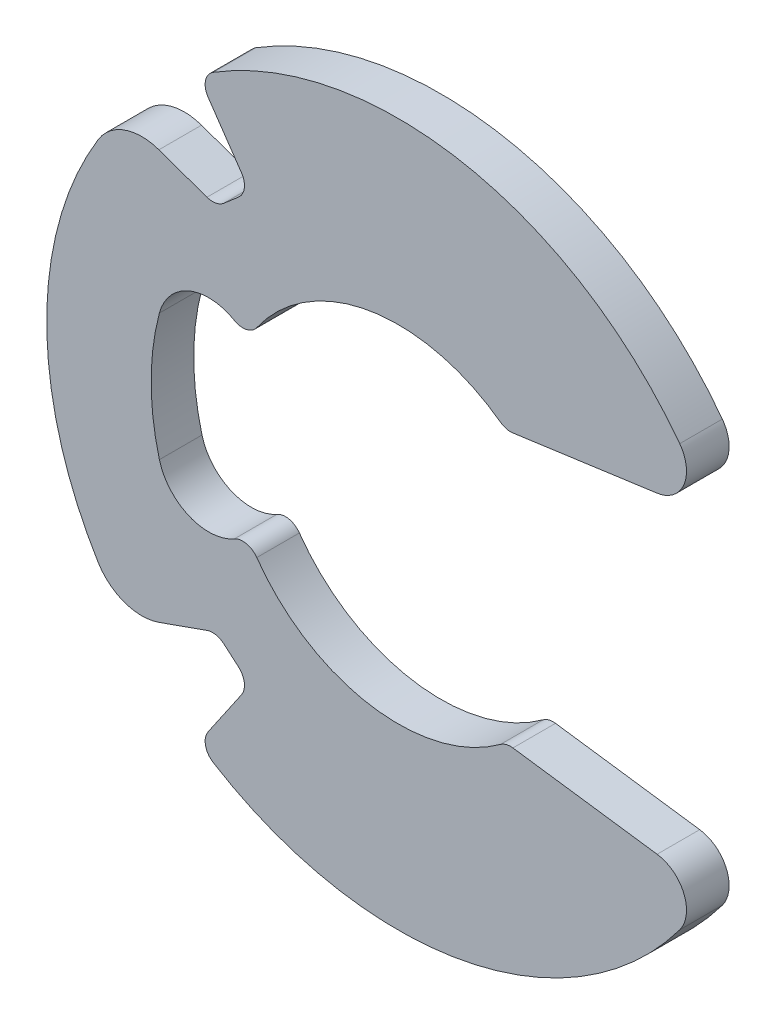
ISO-10303-21;
HEADER;
FILE_DESCRIPTION(('STEP AP214'),'2;1');
FILE_NAME('part.step','',(''),(''),'','','');
FILE_SCHEMA(('AUTOMOTIVE_DESIGN { 1 0 10303 214 1 1 1 1 }'));
ENDSEC;
DATA;
#1=APPLICATION_CONTEXT('core data for automotive mechanical design processes');
#2=APPLICATION_PROTOCOL_DEFINITION('international standard','automotive_design',2000,#1);
#3=PRODUCT_CONTEXT('',#1,'mechanical');
#4=PRODUCT('Part','Part','',(#3));
#5=PRODUCT_RELATED_PRODUCT_CATEGORY('part','',(#4));
#6=PRODUCT_DEFINITION_FORMATION('','',#4);
#7=PRODUCT_DEFINITION_CONTEXT('part definition',#1,'design');
#8=PRODUCT_DEFINITION('design','',#6,#7);
#9=PRODUCT_DEFINITION_SHAPE('','',#8);
#10=(LENGTH_UNIT() NAMED_UNIT(*) SI_UNIT(.MILLI.,.METRE.));
#11=(NAMED_UNIT(*) PLANE_ANGLE_UNIT() SI_UNIT($,.RADIAN.));
#12=(NAMED_UNIT(*) SI_UNIT($,.STERADIAN.) SOLID_ANGLE_UNIT());
#13=UNCERTAINTY_MEASURE_WITH_UNIT(LENGTH_MEASURE(1.E-05),#10,'distance_accuracy_value','');
#14=(GEOMETRIC_REPRESENTATION_CONTEXT(3) GLOBAL_UNCERTAINTY_ASSIGNED_CONTEXT((#13)) GLOBAL_UNIT_ASSIGNED_CONTEXT((#10,
#11,#12)) REPRESENTATION_CONTEXT('',''));
#15=CARTESIAN_POINT('',(0.,0.,0.));
#16=DIRECTION('',(0.,0.,1.));
#17=DIRECTION('',(1.,0.,0.));
#18=AXIS2_PLACEMENT_3D('',#15,#16,#17);
#19=CARTESIAN_POINT('',(0.,0.,1.27));
#20=DIRECTION('',(0.,0.,-1.));
#21=DIRECTION('',(-1.,0.,0.));
#22=AXIS2_PLACEMENT_3D('',#19,#20,#21);
#23=PLANE('',#22);
#24=CARTESIAN_POINT('',(0.,0.,1.27));
#25=DIRECTION('',(0.,0.,-1.));
#26=DIRECTION('',(1.,0.,0.));
#27=AXIS2_PLACEMENT_3D('',#24,#25,#26);
#28=CIRCLE('',#27,10.4775);
#29=CARTESIAN_POINT('',(8.39050144990017,-6.27514873682076,1.27));
#30=VERTEX_POINT('',#29);
#31=CARTESIAN_POINT('',(-5.51465485817055,-8.90879273780998,1.27));
#32=VERTEX_POINT('',#31);
#33=EDGE_CURVE('E433',#30,#32,#28,.T.);
#34=ORIENTED_EDGE('',*,*,#33,.F.);
#35=CARTESIAN_POINT('',(7.57687706687955,-5.66664946537147,1.27));
#36=DIRECTION('',(0.,0.,-1.));
#37=DIRECTION('',(-1.,0.,0.));
#38=AXIS2_PLACEMENT_3D('',#35,#36,#37);
#39=CIRCLE('',#38,1.016);
#40=CARTESIAN_POINT('',(7.71621548730132,-4.66024954258016,1.27));
#41=VERTEX_POINT('',#40);
#42=EDGE_CURVE('E11',#30,#41,#39,.F.);
#43=ORIENTED_EDGE('',*,*,#42,.T.);
#44=DIRECTION('',(0.990551105109562,-0.137144114588364,0.));
#45=VECTOR('',#44,1.);
#46=CARTESIAN_POINT('',(0.,-3.59192148204873,1.27));
#47=LINE('',#46,#45);
#48=CARTESIAN_POINT('',(3.41825205926127,-4.06518646523744,1.27));
#49=VERTEX_POINT('',#48);
#50=EDGE_CURVE('E397',#49,#41,#47,.T.);
#51=ORIENTED_EDGE('',*,*,#50,.F.);
#52=CARTESIAN_POINT('',(3.34858284905039,-4.5683864266331,1.27));
#53=DIRECTION('',(0.,0.,-1.));
#54=DIRECTION('',(-1.,0.,0.));
#55=AXIS2_PLACEMENT_3D('',#52,#53,#54);
#56=CIRCLE('',#55,0.508);
#57=CARTESIAN_POINT('',(3.04826151729699,-4.15866567088125,1.27));
#58=VERTEX_POINT('',#57);
#59=EDGE_CURVE('E360',#49,#58,#56,.F.);
#60=ORIENTED_EDGE('',*,*,#59,.T.);
#61=CARTESIAN_POINT('',(0.,0.,1.27));
#62=DIRECTION('',(0.,0.,-1.));
#63=DIRECTION('',(1.,0.,0.));
#64=AXIS2_PLACEMENT_3D('',#61,#62,#63);
#65=CIRCLE('',#64,5.1562);
#66=CARTESIAN_POINT('',(-4.21618561440545,-2.96819428354689,1.27));
#67=VERTEX_POINT('',#66);
#68=EDGE_CURVE('E437',#58,#67,#65,.T.);
#69=ORIENTED_EDGE('',*,*,#68,.T.);
#70=CARTESIAN_POINT('',(-4.63157335966707,-3.26062721788649,1.27));
#71=DIRECTION('',(0.,0.,-1.));
#72=DIRECTION('',(-1.,0.,0.));
#73=AXIS2_PLACEMENT_3D('',#70,#71,#72);
#74=CIRCLE('',#73,0.508);
#75=CARTESIAN_POINT('',(-4.88521418696267,-2.82047913970278,1.27));
#76=VERTEX_POINT('',#75);
#77=EDGE_CURVE('E369',#67,#76,#74,.F.);
#78=ORIENTED_EDGE('',*,*,#77,.T.);
#79=CARTESIAN_POINT('',(-5.64613666884946,-1.50003490515168,1.27));
#80=DIRECTION('',(0.,0.,-1.));
#81=DIRECTION('',(-1.,0.,0.));
#82=AXIS2_PLACEMENT_3D('',#79,#80,#81);
#83=CIRCLE('',#82,1.524);
#84=CARTESIAN_POINT('',(-7.11904188681019,-1.89134835866951,1.27));
#85=VERTEX_POINT('',#84);
#86=EDGE_CURVE('E262',#76,#85,#83,.T.);
#87=ORIENTED_EDGE('',*,*,#86,.T.);
#88=CARTESIAN_POINT('',(0.,0.,1.27));
#89=DIRECTION('',(0.,0.,-1.));
#90=DIRECTION('',(0.,1.,0.));
#91=AXIS2_PLACEMENT_3D('',#88,#89,#90);
#92=CIRCLE('',#91,7.366);
#93=CARTESIAN_POINT('',(-7.1190418868102,1.89134835866951,1.27));
#94=VERTEX_POINT('',#93);
#95=EDGE_CURVE('E469',#85,#94,#92,.T.);
#96=ORIENTED_EDGE('',*,*,#95,.T.);
#97=CARTESIAN_POINT('',(-5.64613666884946,1.50003490515168,1.27));
#98=DIRECTION('',(0.,0.,-1.));
#99=DIRECTION('',(-1.,0.,0.));
#100=AXIS2_PLACEMENT_3D('',#97,#98,#99);
#101=CIRCLE('',#100,1.524);
#102=CARTESIAN_POINT('',(-4.88521418696268,2.82047913970278,1.27));
#103=VERTEX_POINT('',#102);
#104=EDGE_CURVE('E270',#94,#103,#101,.T.);
#105=ORIENTED_EDGE('',*,*,#104,.T.);
#106=CARTESIAN_POINT('',(-4.63157335966708,3.26062721788649,1.27));
#107=DIRECTION('',(0.,0.,-1.));
#108=DIRECTION('',(-1.,0.,0.));
#109=AXIS2_PLACEMENT_3D('',#106,#107,#108);
#110=CIRCLE('',#109,0.508);
#111=CARTESIAN_POINT('',(-4.21618561440546,2.96819428354689,1.27));
#112=VERTEX_POINT('',#111);
#113=EDGE_CURVE('E374',#103,#112,#110,.F.);
#114=ORIENTED_EDGE('',*,*,#113,.T.);
#115=CARTESIAN_POINT('',(3.048261517297,4.15866567088126,1.27));
#116=VERTEX_POINT('',#115);
#117=EDGE_CURVE('E435',#112,#116,#65,.T.);
#118=ORIENTED_EDGE('',*,*,#117,.T.);
#119=CARTESIAN_POINT('',(3.3485828490504,4.5683864266331,1.27));
#120=DIRECTION('',(0.,0.,-1.));
#121=DIRECTION('',(-1.,0.,0.));
#122=AXIS2_PLACEMENT_3D('',#119,#120,#121);
#123=CIRCLE('',#122,0.508);
#124=CARTESIAN_POINT('',(3.41825205926129,4.06518646523744,1.27));
#125=VERTEX_POINT('',#124);
#126=EDGE_CURVE('E288',#116,#125,#123,.F.);
#127=ORIENTED_EDGE('',*,*,#126,.T.);
#128=DIRECTION('',(-0.990551105109562,-0.137144114588364,0.));
#129=VECTOR('',#128,1.);
#130=CARTESIAN_POINT('',(11.2983179723503,5.15619999999999,1.27));
#131=LINE('',#130,#129);
#132=CARTESIAN_POINT('',(7.71621548730134,4.66024954258016,1.27));
#133=VERTEX_POINT('',#132);
#134=EDGE_CURVE('E412',#133,#125,#131,.T.);
#135=ORIENTED_EDGE('',*,*,#134,.F.);
#136=CARTESIAN_POINT('',(7.57687706687956,5.66664946537147,1.27));
#137=DIRECTION('',(0.,0.,-1.));
#138=DIRECTION('',(-1.,0.,0.));
#139=AXIS2_PLACEMENT_3D('',#136,#137,#138);
#140=CIRCLE('',#139,1.016);
#141=CARTESIAN_POINT('',(8.39050144990018,6.27514873682076,1.27));
#142=VERTEX_POINT('',#141);
#143=EDGE_CURVE('E383',#133,#142,#140,.F.);
#144=ORIENTED_EDGE('',*,*,#143,.T.);
#145=CARTESIAN_POINT('',(-5.51465485817056,8.90879273780999,1.27));
#146=VERTEX_POINT('',#145);
#147=EDGE_CURVE('E432',#146,#142,#28,.T.);
#148=ORIENTED_EDGE('',*,*,#147,.F.);
#149=CARTESIAN_POINT('',(-5.24727765292592,8.47685127173435,1.27));
#150=DIRECTION('',(0.,0.,-1.));
#151=DIRECTION('',(-1.,0.,0.));
#152=AXIS2_PLACEMENT_3D('',#149,#150,#151);
#153=CIRCLE('',#152,0.508);
#154=CARTESIAN_POINT('',(-5.6664647231543,8.18989099547063,1.27));
#155=VERTEX_POINT('',#154);
#156=EDGE_CURVE('E346',#146,#155,#153,.F.);
#157=ORIENTED_EDGE('',*,*,#156,.T.);
#158=DIRECTION('',(0.564882433590001,-0.825171398087354,0.));
#159=VECTOR('',#158,1.);
#160=CARTESIAN_POINT('',(-7.96096866359448,11.541666359447,1.27));
#161=LINE('',#160,#159);
#162=CARTESIAN_POINT('',(-4.67174469224146,6.73681957776462,1.27));
#163=VERTEX_POINT('',#162);
#164=EDGE_CURVE('E466',#155,#163,#161,.T.);
#165=ORIENTED_EDGE('',*,*,#164,.T.);
#166=CARTESIAN_POINT('',(-5.09093176246983,6.4498593015009,1.27));
#167=DIRECTION('',(0.,0.,-1.));
#168=DIRECTION('',(-1.,0.,0.));
#169=AXIS2_PLACEMENT_3D('',#166,#167,#168);
#170=CIRCLE('',#169,0.508);
#171=CARTESIAN_POINT('',(-4.75923843445855,6.0650950410078,1.27));
#172=VERTEX_POINT('',#171);
#173=EDGE_CURVE('E318',#163,#172,#170,.T.);
#174=ORIENTED_EDGE('',*,*,#173,.T.);
#175=DIRECTION('',(-0.757409961600578,-0.652939622069462,0.));
#176=VECTOR('',#175,1.);
#177=CARTESIAN_POINT('',(-4.41503502304148,6.36182211981562,1.27));
#178=LINE('',#177,#176);
#179=CARTESIAN_POINT('',(-5.19974545035898,5.68534761350743,1.27));
#180=VERTEX_POINT('',#179);
#181=EDGE_CURVE('E461',#172,#180,#178,.T.);
#182=ORIENTED_EDGE('',*,*,#181,.T.);
#183=CARTESIAN_POINT('',(-5.53143877837027,6.07011187400052,1.27));
#184=DIRECTION('',(0.,0.,-1.));
#185=DIRECTION('',(-1.,0.,0.));
#186=AXIS2_PLACEMENT_3D('',#183,#184,#185);
#187=CIRCLE('',#186,0.508);
#188=CARTESIAN_POINT('',(-5.70123922502142,5.59133028672186,1.27));
#189=VERTEX_POINT('',#188);
#190=EDGE_CURVE('E309',#180,#189,#187,.T.);
#191=ORIENTED_EDGE('',*,*,#190,.T.);
#192=DIRECTION('',(-0.942483439524914,0.334252847738487,0.));
#193=VECTOR('',#192,1.);
#194=CARTESIAN_POINT('',(-5.42319262672811,5.49272073732714,1.27));
#195=LINE('',#194,#193);
#196=CARTESIAN_POINT('',(-7.13394241485243,6.09944013892937,1.27));
#197=VERTEX_POINT('',#196);
#198=EDGE_CURVE('E455',#189,#197,#195,.T.);
#199=ORIENTED_EDGE('',*,*,#198,.T.);
#200=CARTESIAN_POINT('',(-7.64334375480589,4.6630953770934,1.27));
#201=DIRECTION('',(0.,0.,-1.));
#202=DIRECTION('',(-1.,0.,0.));
#203=AXIS2_PLACEMENT_3D('',#200,#201,#202);
#204=CIRCLE('',#203,1.524);
#205=CARTESIAN_POINT('',(-8.94433843647498,5.45681373915185,1.27));
#206=VERTEX_POINT('',#205);
#207=EDGE_CURVE('E283',#197,#206,#204,.F.);
#208=ORIENTED_EDGE('',*,*,#207,.T.);
#209=CARTESIAN_POINT('',(-8.94433843647497,-5.45681373915185,1.27));
#210=VERTEX_POINT('',#209);
#211=EDGE_CURVE('E436',#210,#206,#28,.T.);
#212=ORIENTED_EDGE('',*,*,#211,.F.);
#213=CARTESIAN_POINT('',(-7.64334375480588,-4.6630953770934,1.27));
#214=DIRECTION('',(0.,0.,-1.));
#215=DIRECTION('',(-1.,0.,0.));
#216=AXIS2_PLACEMENT_3D('',#213,#214,#215);
#217=CIRCLE('',#216,1.524);
#218=CARTESIAN_POINT('',(-7.13394241485243,-6.09944013892937,1.27));
#219=VERTEX_POINT('',#218);
#220=EDGE_CURVE('E257',#210,#219,#217,.F.);
#221=ORIENTED_EDGE('',*,*,#220,.T.);
#222=DIRECTION('',(-0.942483439524914,-0.334252847738487,0.));
#223=VECTOR('',#222,1.);
#224=CARTESIAN_POINT('',(-5.42319262672811,-5.49272073732714,1.27));
#225=LINE('',#224,#223);
#226=CARTESIAN_POINT('',(-5.70123922502142,-5.59133028672186,1.27));
#227=VERTEX_POINT('',#226);
#228=EDGE_CURVE('E228',#227,#219,#225,.T.);
#229=ORIENTED_EDGE('',*,*,#228,.F.);
#230=CARTESIAN_POINT('',(-5.53143877837027,-6.07011187400052,1.27));
#231=DIRECTION('',(0.,0.,-1.));
#232=DIRECTION('',(-1.,0.,0.));
#233=AXIS2_PLACEMENT_3D('',#230,#231,#232);
#234=CIRCLE('',#233,0.508);
#235=CARTESIAN_POINT('',(-5.19974545035898,-5.68534761350743,1.27));
#236=VERTEX_POINT('',#235);
#237=EDGE_CURVE('E300',#227,#236,#234,.T.);
#238=ORIENTED_EDGE('',*,*,#237,.T.);
#239=DIRECTION('',(-0.757409961600578,0.652939622069462,0.));
#240=VECTOR('',#239,1.);
#241=CARTESIAN_POINT('',(-4.41503502304148,-6.36182211981562,1.27));
#242=LINE('',#241,#240);
#243=CARTESIAN_POINT('',(-4.75923843445855,-6.0650950410078,1.27));
#244=VERTEX_POINT('',#243);
#245=EDGE_CURVE('E422',#244,#236,#242,.T.);
#246=ORIENTED_EDGE('',*,*,#245,.F.);
#247=CARTESIAN_POINT('',(-5.09093176246983,-6.4498593015009,1.27));
#248=DIRECTION('',(0.,0.,-1.));
#249=DIRECTION('',(-1.,0.,0.));
#250=AXIS2_PLACEMENT_3D('',#247,#248,#249);
#251=CIRCLE('',#250,0.508);
#252=CARTESIAN_POINT('',(-4.67174469224146,-6.73681957776462,1.27));
#253=VERTEX_POINT('',#252);
#254=EDGE_CURVE('E327',#244,#253,#251,.T.);
#255=ORIENTED_EDGE('',*,*,#254,.T.);
#256=DIRECTION('',(0.564882433590001,0.825171398087354,0.));
#257=VECTOR('',#256,1.);
#258=CARTESIAN_POINT('',(-7.96096866359448,-11.541666359447,1.27));
#259=LINE('',#258,#257);
#260=CARTESIAN_POINT('',(-5.66646472315429,-8.18989099547062,1.27));
#261=VERTEX_POINT('',#260);
#262=EDGE_CURVE('E452',#261,#253,#259,.T.);
#263=ORIENTED_EDGE('',*,*,#262,.F.);
#264=CARTESIAN_POINT('',(-5.24727765292592,-8.47685127173434,1.27));
#265=DIRECTION('',(0.,0.,-1.));
#266=DIRECTION('',(-1.,0.,0.));
#267=AXIS2_PLACEMENT_3D('',#264,#265,#266);
#268=CIRCLE('',#267,0.508);
#269=EDGE_CURVE('E335',#261,#32,#268,.F.);
#270=ORIENTED_EDGE('',*,*,#269,.T.);
#271=EDGE_LOOP('',(#34,#43,#51,#60,#69,#78,#87,#96,#105,#114,#118,#127,#135,#144,#148,#157,#165,
#174,#182,#191,#199,#208,#212,#221,#229,#238,#246,#255,#263,#270));
#272=FACE_BOUND('',#271,.T.);
#273=ADVANCED_FACE('F16',(#272),#23,.F.);
#274=CARTESIAN_POINT('',(0.,0.,0.));
#275=DIRECTION('',(0.,0.,-1.));
#276=DIRECTION('',(-1.,0.,0.));
#277=AXIS2_PLACEMENT_3D('',#274,#275,#276);
#278=PLANE('',#277);
#279=DIRECTION('',(-0.990551105109562,0.137144114588364,0.));
#280=VECTOR('',#279,1.);
#281=CARTESIAN_POINT('',(-0.487956262792466,-3.52436279752117,0.));
#282=LINE('',#281,#280);
#283=CARTESIAN_POINT('',(7.71621548730133,-4.66024954258016,0.));
#284=VERTEX_POINT('',#283);
#285=CARTESIAN_POINT('',(3.41825205926127,-4.06518646523744,0.));
#286=VERTEX_POINT('',#285);
#287=EDGE_CURVE('E237',#284,#286,#282,.T.);
#288=ORIENTED_EDGE('',*,*,#287,.F.);
#289=CARTESIAN_POINT('',(7.57687706687955,-5.66664946537147,0.));
#290=DIRECTION('',(0.,0.,-1.));
#291=DIRECTION('',(-1.,0.,0.));
#292=AXIS2_PLACEMENT_3D('',#289,#290,#291);
#293=CIRCLE('',#292,1.016);
#294=CARTESIAN_POINT('',(8.39050144990017,-6.27514873682076,0.));
#295=VERTEX_POINT('',#294);
#296=EDGE_CURVE('E38',#284,#295,#293,.T.);
#297=ORIENTED_EDGE('',*,*,#296,.T.);
#298=CARTESIAN_POINT('',(0.,0.,0.));
#299=DIRECTION('',(0.,0.,-1.));
#300=DIRECTION('',(1.,0.,0.));
#301=AXIS2_PLACEMENT_3D('',#298,#299,#300);
#302=CIRCLE('',#301,10.4775);
#303=CARTESIAN_POINT('',(-5.51465485817055,-8.90879273780998,0.));
#304=VERTEX_POINT('',#303);
#305=EDGE_CURVE('E426',#295,#304,#302,.T.);
#306=ORIENTED_EDGE('',*,*,#305,.T.);
#307=CARTESIAN_POINT('',(-5.24727765292592,-8.47685127173434,0.));
#308=DIRECTION('',(0.,0.,-1.));
#309=DIRECTION('',(-1.,0.,0.));
#310=AXIS2_PLACEMENT_3D('',#307,#308,#309);
#311=CIRCLE('',#310,0.508);
#312=CARTESIAN_POINT('',(-5.6664647231543,-8.18989099547062,0.));
#313=VERTEX_POINT('',#312);
#314=EDGE_CURVE('E341',#304,#313,#311,.T.);
#315=ORIENTED_EDGE('',*,*,#314,.T.);
#316=DIRECTION('',(-0.56488243359,-0.825171398087354,0.));
#317=VECTOR('',#316,1.);
#318=CARTESIAN_POINT('',(-0.0408287063206822,0.0279498526490687,0.));
#319=LINE('',#318,#317);
#320=CARTESIAN_POINT('',(-4.67174469224146,-6.73681957776462,0.));
#321=VERTEX_POINT('',#320);
#322=EDGE_CURVE('E240',#321,#313,#319,.T.);
#323=ORIENTED_EDGE('',*,*,#322,.F.);
#324=CARTESIAN_POINT('',(-5.09093176246983,-6.4498593015009,0.));
#325=DIRECTION('',(0.,0.,-1.));
#326=DIRECTION('',(-1.,0.,0.));
#327=AXIS2_PLACEMENT_3D('',#324,#325,#326);
#328=CIRCLE('',#327,0.508);
#329=CARTESIAN_POINT('',(-4.75923843445854,-6.0650950410078,0.));
#330=VERTEX_POINT('',#329);
#331=EDGE_CURVE('E330',#321,#330,#328,.F.);
#332=ORIENTED_EDGE('',*,*,#331,.T.);
#333=DIRECTION('',(0.757409961600578,-0.652939622069462,0.));
#334=VECTOR('',#333,1.);
#335=CARTESIAN_POINT('',(-5.02845697562567,-5.8330100917258,0.));
#336=LINE('',#335,#334);
#337=CARTESIAN_POINT('',(-5.19974545035898,-5.68534761350743,0.));
#338=VERTEX_POINT('',#337);
#339=EDGE_CURVE('E236',#338,#330,#336,.T.);
#340=ORIENTED_EDGE('',*,*,#339,.F.);
#341=CARTESIAN_POINT('',(-5.53143877837027,-6.07011187400052,0.));
#342=DIRECTION('',(0.,0.,-1.));
#343=DIRECTION('',(-1.,0.,0.));
#344=AXIS2_PLACEMENT_3D('',#341,#342,#343);
#345=CIRCLE('',#344,0.508);
#346=CARTESIAN_POINT('',(-5.70123922502142,-5.59133028672186,0.));
#347=VERTEX_POINT('',#346);
#348=EDGE_CURVE('E235',#338,#347,#345,.F.);
#349=ORIENTED_EDGE('',*,*,#348,.T.);
#350=DIRECTION('',(0.942483439524914,0.334252847738487,0.));
#351=VECTOR('',#350,1.);
#352=CARTESIAN_POINT('',(1.12445357189555,-3.17059039944317,0.));
#353=LINE('',#352,#351);
#354=CARTESIAN_POINT('',(-7.13394241485243,-6.09944013892937,0.));
#355=VERTEX_POINT('',#354);
#356=EDGE_CURVE('E225',#355,#347,#353,.T.);
#357=ORIENTED_EDGE('',*,*,#356,.F.);
#358=CARTESIAN_POINT('',(-7.64334375480588,-4.6630953770934,0.));
#359=DIRECTION('',(0.,0.,-1.));
#360=DIRECTION('',(-1.,0.,0.));
#361=AXIS2_PLACEMENT_3D('',#358,#359,#360);
#362=CIRCLE('',#361,1.524);
#363=CARTESIAN_POINT('',(-8.94433843647497,-5.45681373915185,0.));
#364=VERTEX_POINT('',#363);
#365=EDGE_CURVE('E211',#355,#364,#362,.T.);
#366=ORIENTED_EDGE('',*,*,#365,.T.);
#367=CARTESIAN_POINT('',(-8.94433843647498,5.45681373915185,0.));
#368=VERTEX_POINT('',#367);
#369=EDGE_CURVE('E430',#364,#368,#302,.T.);
#370=ORIENTED_EDGE('',*,*,#369,.T.);
#371=CARTESIAN_POINT('',(-7.64334375480589,4.6630953770934,0.));
#372=DIRECTION('',(0.,0.,-1.));
#373=DIRECTION('',(-1.,0.,0.));
#374=AXIS2_PLACEMENT_3D('',#371,#372,#373);
#375=CIRCLE('',#374,1.524);
#376=CARTESIAN_POINT('',(-7.13394241485243,6.09944013892937,0.));
#377=VERTEX_POINT('',#376);
#378=EDGE_CURVE('E278',#368,#377,#375,.T.);
#379=ORIENTED_EDGE('',*,*,#378,.T.);
#380=DIRECTION('',(0.942483439524914,-0.334252847738487,0.));
#381=VECTOR('',#380,1.);
#382=CARTESIAN_POINT('',(1.12445357189554,3.17059039944317,0.));
#383=LINE('',#382,#381);
#384=CARTESIAN_POINT('',(-5.70123922502143,5.59133028672186,0.));
#385=VERTEX_POINT('',#384);
#386=EDGE_CURVE('E252',#377,#385,#383,.T.);
#387=ORIENTED_EDGE('',*,*,#386,.T.);
#388=CARTESIAN_POINT('',(-5.53143877837027,6.07011187400052,0.));
#389=DIRECTION('',(0.,0.,-1.));
#390=DIRECTION('',(-1.,0.,0.));
#391=AXIS2_PLACEMENT_3D('',#388,#389,#390);
#392=CIRCLE('',#391,0.508);
#393=CARTESIAN_POINT('',(-5.19974545035898,5.68534761350743,0.));
#394=VERTEX_POINT('',#393);
#395=EDGE_CURVE('E311',#385,#394,#392,.F.);
#396=ORIENTED_EDGE('',*,*,#395,.T.);
#397=DIRECTION('',(0.757409961600578,0.652939622069462,0.));
#398=VECTOR('',#397,1.);
#399=CARTESIAN_POINT('',(-5.02845697562567,5.8330100917258,0.));
#400=LINE('',#399,#398);
#401=CARTESIAN_POINT('',(-4.75923843445855,6.0650950410078,0.));
#402=VERTEX_POINT('',#401);
#403=EDGE_CURVE('E249',#394,#402,#400,.T.);
#404=ORIENTED_EDGE('',*,*,#403,.T.);
#405=CARTESIAN_POINT('',(-5.09093176246983,6.4498593015009,0.));
#406=DIRECTION('',(0.,0.,-1.));
#407=DIRECTION('',(-1.,0.,0.));
#408=AXIS2_PLACEMENT_3D('',#405,#406,#407);
#409=CIRCLE('',#408,0.508);
#410=CARTESIAN_POINT('',(-4.67174469224146,6.73681957776462,0.));
#411=VERTEX_POINT('',#410);
#412=EDGE_CURVE('E320',#402,#411,#409,.F.);
#413=ORIENTED_EDGE('',*,*,#412,.T.);
#414=DIRECTION('',(-0.564882433590001,0.825171398087354,0.));
#415=VECTOR('',#414,1.);
#416=CARTESIAN_POINT('',(-0.0408287063206891,-0.0279498526490583,0.));
#417=LINE('',#416,#415);
#418=CARTESIAN_POINT('',(-5.6664647231543,8.18989099547063,0.));
#419=VERTEX_POINT('',#418);
#420=EDGE_CURVE('E246',#411,#419,#417,.T.);
#421=ORIENTED_EDGE('',*,*,#420,.T.);
#422=CARTESIAN_POINT('',(-5.24727765292592,8.47685127173435,0.));
#423=DIRECTION('',(0.,0.,-1.));
#424=DIRECTION('',(-1.,0.,0.));
#425=AXIS2_PLACEMENT_3D('',#422,#423,#424);
#426=CIRCLE('',#425,0.508);
#427=CARTESIAN_POINT('',(-5.51465485817056,8.90879273780999,0.));
#428=VERTEX_POINT('',#427);
#429=EDGE_CURVE('E350',#419,#428,#426,.T.);
#430=ORIENTED_EDGE('',*,*,#429,.T.);
#431=CARTESIAN_POINT('',(8.39050144990018,6.27514873682076,0.));
#432=VERTEX_POINT('',#431);
#433=EDGE_CURVE('E419',#428,#432,#302,.T.);
#434=ORIENTED_EDGE('',*,*,#433,.T.);
#435=CARTESIAN_POINT('',(7.57687706687956,5.66664946537147,0.));
#436=DIRECTION('',(0.,0.,-1.));
#437=DIRECTION('',(-1.,0.,0.));
#438=AXIS2_PLACEMENT_3D('',#435,#436,#437);
#439=CIRCLE('',#438,1.016);
#440=CARTESIAN_POINT('',(7.71621548730134,4.66024954258016,0.));
#441=VERTEX_POINT('',#440);
#442=EDGE_CURVE('E387',#432,#441,#439,.T.);
#443=ORIENTED_EDGE('',*,*,#442,.T.);
#444=DIRECTION('',(0.990551105109562,0.137144114588364,0.));
#445=VECTOR('',#444,1.);
#446=CARTESIAN_POINT('',(-0.487956262792459,3.52436279752117,0.));
#447=LINE('',#446,#445);
#448=CARTESIAN_POINT('',(3.41825205926129,4.06518646523744,0.));
#449=VERTEX_POINT('',#448);
#450=EDGE_CURVE('E242',#449,#441,#447,.T.);
#451=ORIENTED_EDGE('',*,*,#450,.F.);
#452=CARTESIAN_POINT('',(3.3485828490504,4.5683864266331,0.));
#453=DIRECTION('',(0.,0.,-1.));
#454=DIRECTION('',(-1.,0.,0.));
#455=AXIS2_PLACEMENT_3D('',#452,#453,#454);
#456=CIRCLE('',#455,0.508);
#457=CARTESIAN_POINT('',(3.048261517297,4.15866567088126,0.));
#458=VERTEX_POINT('',#457);
#459=EDGE_CURVE('E293',#449,#458,#456,.T.);
#460=ORIENTED_EDGE('',*,*,#459,.T.);
#461=CARTESIAN_POINT('',(0.,0.,0.));
#462=DIRECTION('',(0.,0.,-1.));
#463=DIRECTION('',(1.,0.,0.));
#464=AXIS2_PLACEMENT_3D('',#461,#462,#463);
#465=CIRCLE('',#464,5.1562);
#466=CARTESIAN_POINT('',(-4.21618561440546,2.96819428354689,0.));
#467=VERTEX_POINT('',#466);
#468=EDGE_CURVE('E429',#467,#458,#465,.T.);
#469=ORIENTED_EDGE('',*,*,#468,.F.);
#470=CARTESIAN_POINT('',(-4.63157335966708,3.26062721788649,0.));
#471=DIRECTION('',(0.,0.,-1.));
#472=DIRECTION('',(-1.,0.,0.));
#473=AXIS2_PLACEMENT_3D('',#470,#471,#472);
#474=CIRCLE('',#473,0.508);
#475=CARTESIAN_POINT('',(-4.88521418696268,2.82047913970278,0.));
#476=VERTEX_POINT('',#475);
#477=EDGE_CURVE('E378',#467,#476,#474,.T.);
#478=ORIENTED_EDGE('',*,*,#477,.T.);
#479=CARTESIAN_POINT('',(-5.64613666884946,1.50003490515168,0.));
#480=DIRECTION('',(0.,0.,-1.));
#481=DIRECTION('',(-1.,0.,0.));
#482=AXIS2_PLACEMENT_3D('',#479,#480,#481);
#483=CIRCLE('',#482,1.524);
#484=CARTESIAN_POINT('',(-7.1190418868102,1.89134835866951,0.));
#485=VERTEX_POINT('',#484);
#486=EDGE_CURVE('E273',#476,#485,#483,.F.);
#487=ORIENTED_EDGE('',*,*,#486,.T.);
#488=CARTESIAN_POINT('',(0.,0.,0.));
#489=DIRECTION('',(0.,0.,-1.));
#490=DIRECTION('',(-1.,0.,0.));
#491=AXIS2_PLACEMENT_3D('',#488,#489,#490);
#492=CIRCLE('',#491,7.366);
#493=CARTESIAN_POINT('',(-7.11904188681019,-1.89134835866951,0.));
#494=VERTEX_POINT('',#493);
#495=EDGE_CURVE('E230',#485,#494,#492,.F.);
#496=ORIENTED_EDGE('',*,*,#495,.T.);
#497=CARTESIAN_POINT('',(-5.64613666884946,-1.50003490515168,0.));
#498=DIRECTION('',(0.,0.,-1.));
#499=DIRECTION('',(-1.,0.,0.));
#500=AXIS2_PLACEMENT_3D('',#497,#498,#499);
#501=CIRCLE('',#500,1.524);
#502=CARTESIAN_POINT('',(-4.88521418696267,-2.82047913970278,0.));
#503=VERTEX_POINT('',#502);
#504=EDGE_CURVE('E264',#494,#503,#501,.F.);
#505=ORIENTED_EDGE('',*,*,#504,.T.);
#506=CARTESIAN_POINT('',(-4.63157335966707,-3.26062721788649,0.));
#507=DIRECTION('',(0.,0.,-1.));
#508=DIRECTION('',(-1.,0.,0.));
#509=AXIS2_PLACEMENT_3D('',#506,#507,#508);
#510=CIRCLE('',#509,0.508);
#511=CARTESIAN_POINT('',(-4.21618561440545,-2.96819428354689,0.));
#512=VERTEX_POINT('',#511);
#513=EDGE_CURVE('E365',#503,#512,#510,.T.);
#514=ORIENTED_EDGE('',*,*,#513,.T.);
#515=CARTESIAN_POINT('',(3.04826151729699,-4.15866567088125,0.));
#516=VERTEX_POINT('',#515);
#517=EDGE_CURVE('E403',#516,#512,#465,.T.);
#518=ORIENTED_EDGE('',*,*,#517,.F.);
#519=CARTESIAN_POINT('',(3.34858284905039,-4.5683864266331,0.));
#520=DIRECTION('',(0.,0.,-1.));
#521=DIRECTION('',(-1.,0.,0.));
#522=AXIS2_PLACEMENT_3D('',#519,#520,#521);
#523=CIRCLE('',#522,0.508);
#524=EDGE_CURVE('E355',#516,#286,#523,.T.);
#525=ORIENTED_EDGE('',*,*,#524,.T.);
#526=EDGE_LOOP('',(#288,#297,#306,#315,#323,#332,#340,#349,#357,#366,#370,#379,#387,#396,#404,
#413,#421,#430,#434,#443,#451,#460,#469,#478,#487,#496,#505,#514,#518,#525));
#527=FACE_BOUND('',#526,.T.);
#528=ADVANCED_FACE('F232',(#527),#278,.T.);
#529=CARTESIAN_POINT('',(0.,0.,1.27));
#530=DIRECTION('',(0.,0.,-1.));
#531=DIRECTION('',(-1.,0.,0.));
#532=AXIS2_PLACEMENT_3D('',#529,#530,#531);
#533=CYLINDRICAL_SURFACE('',#532,5.1562);
#534=ORIENTED_EDGE('',*,*,#117,.F.);
#535=DIRECTION('',(0.,0.,-1.));
#536=VECTOR('',#535,1.);
#537=CARTESIAN_POINT('',(-4.21618561440546,2.96819428354689,1.27));
#538=LINE('',#537,#536);
#539=EDGE_CURVE('E376',#112,#467,#538,.T.);
#540=ORIENTED_EDGE('',*,*,#539,.T.);
#541=ORIENTED_EDGE('',*,*,#468,.T.);
#542=DIRECTION('',(0.,0.,-1.));
#543=VECTOR('',#542,1.);
#544=CARTESIAN_POINT('',(3.048261517297,4.15866567088126,1.27));
#545=LINE('',#544,#543);
#546=EDGE_CURVE('E285',#458,#116,#545,.F.);
#547=ORIENTED_EDGE('',*,*,#546,.T.);
#548=EDGE_LOOP('',(#534,#540,#541,#547));
#549=FACE_BOUND('',#548,.T.);
#550=ADVANCED_FACE('F496',(#549),#533,.F.);
#551=ORIENTED_EDGE('',*,*,#517,.T.);
#552=DIRECTION('',(0.,0.,-1.));
#553=VECTOR('',#552,1.);
#554=CARTESIAN_POINT('',(-4.21618561440545,-2.96819428354689,1.27));
#555=LINE('',#554,#553);
#556=EDGE_CURVE('E367',#512,#67,#555,.F.);
#557=ORIENTED_EDGE('',*,*,#556,.T.);
#558=ORIENTED_EDGE('',*,*,#68,.F.);
#559=DIRECTION('',(0.,0.,-1.));
#560=VECTOR('',#559,1.);
#561=CARTESIAN_POINT('',(3.04826151729699,-4.15866567088125,1.27));
#562=LINE('',#561,#560);
#563=EDGE_CURVE('E352',#58,#516,#562,.T.);
#564=ORIENTED_EDGE('',*,*,#563,.T.);
#565=EDGE_LOOP('',(#551,#557,#558,#564));
#566=FACE_BOUND('',#565,.T.);
#567=ADVANCED_FACE('F582',(#566),#533,.F.);
#568=CARTESIAN_POINT('',(0.,0.,1.27));
#569=DIRECTION('',(0.,0.,-1.));
#570=DIRECTION('',(-1.,0.,0.));
#571=AXIS2_PLACEMENT_3D('',#568,#569,#570);
#572=CYLINDRICAL_SURFACE('',#571,10.4775);
#573=ORIENTED_EDGE('',*,*,#147,.T.);
#574=DIRECTION('',(0.,0.,-1.));
#575=VECTOR('',#574,1.);
#576=CARTESIAN_POINT('',(8.39050144990018,6.27514873682076,1.27));
#577=LINE('',#576,#575);
#578=EDGE_CURVE('E385',#142,#432,#577,.T.);
#579=ORIENTED_EDGE('',*,*,#578,.T.);
#580=ORIENTED_EDGE('',*,*,#433,.F.);
#581=DIRECTION('',(0.,0.,-1.));
#582=VECTOR('',#581,1.);
#583=CARTESIAN_POINT('',(-5.51465485817056,8.90879273780999,1.27));
#584=LINE('',#583,#582);
#585=EDGE_CURVE('E343',#428,#146,#584,.F.);
#586=ORIENTED_EDGE('',*,*,#585,.T.);
#587=EDGE_LOOP('',(#573,#579,#580,#586));
#588=FACE_BOUND('',#587,.T.);
#589=ADVANCED_FACE('F18',(#588),#572,.T.);
#590=ORIENTED_EDGE('',*,*,#211,.T.);
#591=DIRECTION('',(0.,0.,-1.));
#592=VECTOR('',#591,1.);
#593=CARTESIAN_POINT('',(-8.94433843647498,5.45681373915186,1.27));
#594=LINE('',#593,#592);
#595=EDGE_CURVE('E275',#206,#368,#594,.T.);
#596=ORIENTED_EDGE('',*,*,#595,.T.);
#597=ORIENTED_EDGE('',*,*,#369,.F.);
#598=DIRECTION('',(0.,0.,-1.));
#599=VECTOR('',#598,1.);
#600=CARTESIAN_POINT('',(-8.94433843647497,-5.45681373915186,1.27));
#601=LINE('',#600,#599);
#602=EDGE_CURVE('E216',#364,#210,#601,.F.);
#603=ORIENTED_EDGE('',*,*,#602,.T.);
#604=EDGE_LOOP('',(#590,#596,#597,#603));
#605=FACE_BOUND('',#604,.T.);
#606=ADVANCED_FACE('F524',(#605),#572,.T.);
#607=ORIENTED_EDGE('',*,*,#305,.F.);
#608=DIRECTION('',(0.,0.,-1.));
#609=VECTOR('',#608,1.);
#610=CARTESIAN_POINT('',(8.39050144990017,-6.27514873682076,1.27));
#611=LINE('',#610,#609);
#612=EDGE_CURVE('E24',#295,#30,#611,.F.);
#613=ORIENTED_EDGE('',*,*,#612,.T.);
#614=ORIENTED_EDGE('',*,*,#33,.T.);
#615=DIRECTION('',(0.,0.,-1.));
#616=VECTOR('',#615,1.);
#617=CARTESIAN_POINT('',(-5.51465485817055,-8.90879273780998,1.27));
#618=LINE('',#617,#616);
#619=EDGE_CURVE('E338',#32,#304,#618,.T.);
#620=ORIENTED_EDGE('',*,*,#619,.T.);
#621=EDGE_LOOP('',(#607,#613,#614,#620));
#622=FACE_BOUND('',#621,.T.);
#623=ADVANCED_FACE('F590',(#622),#572,.T.);
#624=CARTESIAN_POINT('',(0.,-3.59192148204873,-28.9774986298856));
#625=DIRECTION('',(-0.137144114588364,-0.990551105109562,0.));
#626=DIRECTION('',(0.990551105109562,-0.137144114588364,0.));
#627=AXIS2_PLACEMENT_3D('',#624,#625,#626);
#628=PLANE('',#627);
#629=ORIENTED_EDGE('',*,*,#50,.T.);
#630=DIRECTION('',(0.,0.,1.));
#631=VECTOR('',#630,1.);
#632=CARTESIAN_POINT('',(7.71621548730132,-4.66024954258016,0.));
#633=LINE('',#632,#631);
#634=EDGE_CURVE('E389',#41,#284,#633,.F.);
#635=ORIENTED_EDGE('',*,*,#634,.T.);
#636=ORIENTED_EDGE('',*,*,#287,.T.);
#637=DIRECTION('',(0.,0.,-1.));
#638=VECTOR('',#637,1.);
#639=CARTESIAN_POINT('',(3.41825205926127,-4.06518646523744,-28.9774986298856));
#640=LINE('',#639,#638);
#641=EDGE_CURVE('E358',#286,#49,#640,.F.);
#642=ORIENTED_EDGE('',*,*,#641,.T.);
#643=EDGE_LOOP('',(#629,#635,#636,#642));
#644=FACE_BOUND('',#643,.T.);
#645=ADVANCED_FACE('F395',(#644),#628,.F.);
#646=CARTESIAN_POINT('',(11.2983179723503,5.15619999999999,-28.9774986298856));
#647=DIRECTION('',(-0.137144114588364,0.990551105109562,0.));
#648=DIRECTION('',(-0.990551105109562,-0.137144114588364,0.));
#649=AXIS2_PLACEMENT_3D('',#646,#647,#648);
#650=PLANE('',#649);
#651=ORIENTED_EDGE('',*,*,#450,.T.);
#652=DIRECTION('',(0.,0.,1.));
#653=VECTOR('',#652,1.);
#654=CARTESIAN_POINT('',(7.71621548730134,4.66024954258016,1.27));
#655=LINE('',#654,#653);
#656=EDGE_CURVE('E380',#441,#133,#655,.T.);
#657=ORIENTED_EDGE('',*,*,#656,.T.);
#658=ORIENTED_EDGE('',*,*,#134,.T.);
#659=DIRECTION('',(0.,0.,-1.));
#660=VECTOR('',#659,1.);
#661=CARTESIAN_POINT('',(3.41825205926129,4.06518646523744,-28.9774986298856));
#662=LINE('',#661,#660);
#663=EDGE_CURVE('E291',#125,#449,#662,.T.);
#664=ORIENTED_EDGE('',*,*,#663,.T.);
#665=EDGE_LOOP('',(#651,#657,#658,#664));
#666=FACE_BOUND('',#665,.T.);
#667=ADVANCED_FACE('F507',(#666),#650,.F.);
#668=CARTESIAN_POINT('',(-7.96096866359448,-11.541666359447,-28.9619533727259));
#669=DIRECTION('',(0.825171398087354,-0.56488243359,0.));
#670=DIRECTION('',(0.56488243359,0.825171398087354,0.));
#671=AXIS2_PLACEMENT_3D('',#668,#669,#670);
#672=PLANE('',#671);
#673=ORIENTED_EDGE('',*,*,#322,.T.);
#674=DIRECTION('',(0.,0.,1.));
#675=VECTOR('',#674,1.);
#676=CARTESIAN_POINT('',(-5.66646472315429,-8.18989099547062,1.27));
#677=LINE('',#676,#675);
#678=EDGE_CURVE('E332',#313,#261,#677,.T.);
#679=ORIENTED_EDGE('',*,*,#678,.T.);
#680=ORIENTED_EDGE('',*,*,#262,.T.);
#681=DIRECTION('',(0.,0.,1.));
#682=VECTOR('',#681,1.);
#683=CARTESIAN_POINT('',(-4.67174469224146,-6.73681957776462,0.));
#684=LINE('',#683,#682);
#685=EDGE_CURVE('E325',#253,#321,#684,.F.);
#686=ORIENTED_EDGE('',*,*,#685,.T.);
#687=EDGE_LOOP('',(#673,#679,#680,#686));
#688=FACE_BOUND('',#687,.T.);
#689=ADVANCED_FACE('F444',(#688),#672,.F.);
#690=CARTESIAN_POINT('',(-4.41503502304148,-6.36182211981562,-28.9619533727259));
#691=DIRECTION('',(0.652939622069462,0.757409961600577,0.));
#692=DIRECTION('',(-0.757409961600578,0.652939622069462,0.));
#693=AXIS2_PLACEMENT_3D('',#690,#691,#692);
#694=PLANE('',#693);
#695=ORIENTED_EDGE('',*,*,#339,.T.);
#696=DIRECTION('',(0.,0.,1.));
#697=VECTOR('',#696,1.);
#698=CARTESIAN_POINT('',(-4.75923843445855,-6.0650950410078,1.27));
#699=LINE('',#698,#697);
#700=EDGE_CURVE('E322',#330,#244,#699,.T.);
#701=ORIENTED_EDGE('',*,*,#700,.T.);
#702=ORIENTED_EDGE('',*,*,#245,.T.);
#703=DIRECTION('',(0.,0.,1.));
#704=VECTOR('',#703,1.);
#705=CARTESIAN_POINT('',(-5.19974545035898,-5.68534761350743,0.));
#706=LINE('',#705,#704);
#707=EDGE_CURVE('E298',#236,#338,#706,.F.);
#708=ORIENTED_EDGE('',*,*,#707,.T.);
#709=EDGE_LOOP('',(#695,#701,#702,#708));
#710=FACE_BOUND('',#709,.T.);
#711=ADVANCED_FACE('F561',(#710),#694,.F.);
#712=CARTESIAN_POINT('',(-5.42319262672811,-5.49272073732714,-28.9619533727259));
#713=DIRECTION('',(-0.334252847738487,0.942483439524914,0.));
#714=DIRECTION('',(-0.942483439524914,-0.334252847738487,0.));
#715=AXIS2_PLACEMENT_3D('',#712,#713,#714);
#716=PLANE('',#715);
#717=ORIENTED_EDGE('',*,*,#356,.T.);
#718=DIRECTION('',(0.,0.,1.));
#719=VECTOR('',#718,1.);
#720=CARTESIAN_POINT('',(-5.70123922502142,-5.59133028672186,1.26999999999999));
#721=LINE('',#720,#719);
#722=EDGE_CURVE('E296',#347,#227,#721,.T.);
#723=ORIENTED_EDGE('',*,*,#722,.T.);
#724=ORIENTED_EDGE('',*,*,#228,.T.);
#725=DIRECTION('',(0.,0.,1.));
#726=VECTOR('',#725,1.);
#727=CARTESIAN_POINT('',(-7.13394241485243,-6.09944013892937,0.));
#728=LINE('',#727,#726);
#729=EDGE_CURVE('E215',#219,#355,#728,.F.);
#730=ORIENTED_EDGE('',*,*,#729,.T.);
#731=EDGE_LOOP('',(#717,#723,#724,#730));
#732=FACE_BOUND('',#731,.T.);
#733=ADVANCED_FACE('F223',(#732),#716,.F.);
#734=CARTESIAN_POINT('',(-7.96096866359448,11.541666359447,-28.9619533727259));
#735=DIRECTION('',(-0.825171398087354,-0.564882433590001,0.));
#736=DIRECTION('',(0.564882433590001,-0.825171398087354,0.));
#737=AXIS2_PLACEMENT_3D('',#734,#735,#736);
#738=PLANE('',#737);
#739=ORIENTED_EDGE('',*,*,#164,.F.);
#740=DIRECTION('',(0.,0.,-1.));
#741=VECTOR('',#740,1.);
#742=CARTESIAN_POINT('',(-5.6664647231543,8.18989099547063,-28.9619533727259));
#743=LINE('',#742,#741);
#744=EDGE_CURVE('E348',#155,#419,#743,.T.);
#745=ORIENTED_EDGE('',*,*,#744,.T.);
#746=ORIENTED_EDGE('',*,*,#420,.F.);
#747=DIRECTION('',(0.,0.,1.));
#748=VECTOR('',#747,1.);
#749=CARTESIAN_POINT('',(-4.67174469224146,6.73681957776462,1.26999999999999));
#750=LINE('',#749,#748);
#751=EDGE_CURVE('E313',#411,#163,#750,.T.);
#752=ORIENTED_EDGE('',*,*,#751,.T.);
#753=EDGE_LOOP('',(#739,#745,#746,#752));
#754=FACE_BOUND('',#753,.T.);
#755=ADVANCED_FACE('F553',(#754),#738,.T.);
#756=CARTESIAN_POINT('',(-4.41503502304148,6.36182211981562,-28.9619533727259));
#757=DIRECTION('',(-0.652939622069462,0.757409961600578,0.));
#758=DIRECTION('',(-0.757409961600578,-0.652939622069462,0.));
#759=AXIS2_PLACEMENT_3D('',#756,#757,#758);
#760=PLANE('',#759);
#761=ORIENTED_EDGE('',*,*,#181,.F.);
#762=DIRECTION('',(0.,0.,1.));
#763=VECTOR('',#762,1.);
#764=CARTESIAN_POINT('',(-4.75923843445855,6.0650950410078,0.));
#765=LINE('',#764,#763);
#766=EDGE_CURVE('E316',#172,#402,#765,.F.);
#767=ORIENTED_EDGE('',*,*,#766,.T.);
#768=ORIENTED_EDGE('',*,*,#403,.F.);
#769=DIRECTION('',(0.,0.,1.));
#770=VECTOR('',#769,1.);
#771=CARTESIAN_POINT('',(-5.19974545035898,5.68534761350743,1.27));
#772=LINE('',#771,#770);
#773=EDGE_CURVE('E304',#394,#180,#772,.T.);
#774=ORIENTED_EDGE('',*,*,#773,.T.);
#775=EDGE_LOOP('',(#761,#767,#768,#774));
#776=FACE_BOUND('',#775,.T.);
#777=ADVANCED_FACE('F543',(#776),#760,.T.);
#778=CARTESIAN_POINT('',(-5.42319262672811,5.49272073732714,-28.9619533727259));
#779=DIRECTION('',(0.334252847738487,0.942483439524914,0.));
#780=DIRECTION('',(-0.942483439524914,0.334252847738487,0.));
#781=AXIS2_PLACEMENT_3D('',#778,#779,#780);
#782=PLANE('',#781);
#783=ORIENTED_EDGE('',*,*,#198,.F.);
#784=DIRECTION('',(0.,0.,1.));
#785=VECTOR('',#784,1.);
#786=CARTESIAN_POINT('',(-5.70123922502142,5.59133028672186,0.));
#787=LINE('',#786,#785);
#788=EDGE_CURVE('E307',#189,#385,#787,.F.);
#789=ORIENTED_EDGE('',*,*,#788,.T.);
#790=ORIENTED_EDGE('',*,*,#386,.F.);
#791=DIRECTION('',(0.,0.,-1.));
#792=VECTOR('',#791,1.);
#793=CARTESIAN_POINT('',(-7.13394241485243,6.09944013892937,-28.9619533727259));
#794=LINE('',#793,#792);
#795=EDGE_CURVE('E280',#377,#197,#794,.F.);
#796=ORIENTED_EDGE('',*,*,#795,.T.);
#797=EDGE_LOOP('',(#783,#789,#790,#796));
#798=FACE_BOUND('',#797,.T.);
#799=ADVANCED_FACE('F533',(#798),#782,.T.);
#800=CARTESIAN_POINT('',(0.,0.,-27.5542820641455));
#801=DIRECTION('',(0.,0.,1.));
#802=DIRECTION('',(1.,0.,0.));
#803=AXIS2_PLACEMENT_3D('',#800,#801,#802);
#804=CYLINDRICAL_SURFACE('',#803,7.366);
#805=ORIENTED_EDGE('',*,*,#495,.F.);
#806=DIRECTION('',(0.,0.,1.));
#807=VECTOR('',#806,1.);
#808=CARTESIAN_POINT('',(-7.1190418868102,1.89134835866951,-27.5542820641455));
#809=LINE('',#808,#807);
#810=EDGE_CURVE('E267',#485,#94,#809,.T.);
#811=ORIENTED_EDGE('',*,*,#810,.T.);
#812=ORIENTED_EDGE('',*,*,#95,.F.);
#813=DIRECTION('',(0.,0.,1.));
#814=VECTOR('',#813,1.);
#815=CARTESIAN_POINT('',(-7.11904188681019,-1.89134835866951,-27.5542820641455));
#816=LINE('',#815,#814);
#817=EDGE_CURVE('E259',#85,#494,#816,.F.);
#818=ORIENTED_EDGE('',*,*,#817,.T.);
#819=EDGE_LOOP('',(#805,#811,#812,#818));
#820=FACE_BOUND('',#819,.T.);
#821=ADVANCED_FACE('F479',(#820),#804,.F.);
#822=CARTESIAN_POINT('',(-7.64334375480588,-4.6630953770934,1.27));
#823=DIRECTION('',(0.,0.,-1.));
#824=DIRECTION('',(-1.,0.,0.));
#825=AXIS2_PLACEMENT_3D('',#822,#823,#824);
#826=CYLINDRICAL_SURFACE('',#825,1.524);
#827=ORIENTED_EDGE('',*,*,#220,.F.);
#828=ORIENTED_EDGE('',*,*,#602,.F.);
#829=ORIENTED_EDGE('',*,*,#365,.F.);
#830=ORIENTED_EDGE('',*,*,#729,.F.);
#831=EDGE_LOOP('',(#827,#828,#829,#830));
#832=FACE_BOUND('',#831,.T.);
#833=ADVANCED_FACE('F214',(#832),#826,.T.);
#834=CARTESIAN_POINT('',(-5.64613666884946,-1.50003490515168,-27.5542820641455));
#835=DIRECTION('',(0.,0.,1.));
#836=DIRECTION('',(1.,0.,0.));
#837=AXIS2_PLACEMENT_3D('',#834,#835,#836);
#838=CYLINDRICAL_SURFACE('',#837,1.524);
#839=ORIENTED_EDGE('',*,*,#86,.F.);
#840=DIRECTION('',(0.,0.,1.));
#841=VECTOR('',#840,1.);
#842=CARTESIAN_POINT('',(-4.88521418696267,-2.82047913970278,-27.5542820641455));
#843=LINE('',#842,#841);
#844=EDGE_CURVE('E362',#76,#503,#843,.F.);
#845=ORIENTED_EDGE('',*,*,#844,.T.);
#846=ORIENTED_EDGE('',*,*,#504,.F.);
#847=ORIENTED_EDGE('',*,*,#817,.F.);
#848=EDGE_LOOP('',(#839,#845,#846,#847));
#849=FACE_BOUND('',#848,.T.);
#850=ADVANCED_FACE('F483',(#849),#838,.F.);
#851=CARTESIAN_POINT('',(-5.64613666884946,1.50003490515168,-27.5542820641455));
#852=DIRECTION('',(0.,0.,1.));
#853=DIRECTION('',(1.,0.,0.));
#854=AXIS2_PLACEMENT_3D('',#851,#852,#853);
#855=CYLINDRICAL_SURFACE('',#854,1.524);
#856=ORIENTED_EDGE('',*,*,#486,.F.);
#857=DIRECTION('',(0.,0.,1.));
#858=VECTOR('',#857,1.);
#859=CARTESIAN_POINT('',(-4.88521418696268,2.82047913970279,-27.5542820641455));
#860=LINE('',#859,#858);
#861=EDGE_CURVE('E371',#476,#103,#860,.T.);
#862=ORIENTED_EDGE('',*,*,#861,.T.);
#863=ORIENTED_EDGE('',*,*,#104,.F.);
#864=ORIENTED_EDGE('',*,*,#810,.F.);
#865=EDGE_LOOP('',(#856,#862,#863,#864));
#866=FACE_BOUND('',#865,.T.);
#867=ADVANCED_FACE('F487',(#866),#855,.F.);
#868=CARTESIAN_POINT('',(-7.64334375480589,4.6630953770934,1.27));
#869=DIRECTION('',(0.,0.,-1.));
#870=DIRECTION('',(-1.,0.,0.));
#871=AXIS2_PLACEMENT_3D('',#868,#869,#870);
#872=CYLINDRICAL_SURFACE('',#871,1.524);
#873=ORIENTED_EDGE('',*,*,#207,.F.);
#874=ORIENTED_EDGE('',*,*,#795,.F.);
#875=ORIENTED_EDGE('',*,*,#378,.F.);
#876=ORIENTED_EDGE('',*,*,#595,.F.);
#877=EDGE_LOOP('',(#873,#874,#875,#876));
#878=FACE_BOUND('',#877,.T.);
#879=ADVANCED_FACE('F529',(#878),#872,.T.);
#880=CARTESIAN_POINT('',(3.3485828490504,4.5683864266331,1.27));
#881=DIRECTION('',(0.,0.,-1.));
#882=DIRECTION('',(-1.,0.,0.));
#883=AXIS2_PLACEMENT_3D('',#880,#881,#882);
#884=CYLINDRICAL_SURFACE('',#883,0.508);
#885=ORIENTED_EDGE('',*,*,#459,.F.);
#886=ORIENTED_EDGE('',*,*,#663,.F.);
#887=ORIENTED_EDGE('',*,*,#126,.F.);
#888=ORIENTED_EDGE('',*,*,#546,.F.);
#889=EDGE_LOOP('',(#885,#886,#887,#888));
#890=FACE_BOUND('',#889,.T.);
#891=ADVANCED_FACE('F501',(#890),#884,.T.);
#892=CARTESIAN_POINT('',(-5.53143877837027,-6.07011187400052,-28.9619533727259));
#893=DIRECTION('',(0.,0.,-1.));
#894=DIRECTION('',(-1.,0.,0.));
#895=AXIS2_PLACEMENT_3D('',#892,#893,#894);
#896=CYLINDRICAL_SURFACE('',#895,0.508);
#897=ORIENTED_EDGE('',*,*,#348,.F.);
#898=ORIENTED_EDGE('',*,*,#707,.F.);
#899=ORIENTED_EDGE('',*,*,#237,.F.);
#900=ORIENTED_EDGE('',*,*,#722,.F.);
#901=EDGE_LOOP('',(#897,#898,#899,#900));
#902=FACE_BOUND('',#901,.T.);
#903=ADVANCED_FACE('F559',(#902),#896,.F.);
#904=CARTESIAN_POINT('',(-5.53143877837027,6.07011187400052,-28.9619533727259));
#905=DIRECTION('',(0.,0.,-1.));
#906=DIRECTION('',(-1.,0.,0.));
#907=AXIS2_PLACEMENT_3D('',#904,#905,#906);
#908=CYLINDRICAL_SURFACE('',#907,0.508);
#909=ORIENTED_EDGE('',*,*,#395,.F.);
#910=ORIENTED_EDGE('',*,*,#788,.F.);
#911=ORIENTED_EDGE('',*,*,#190,.F.);
#912=ORIENTED_EDGE('',*,*,#773,.F.);
#913=EDGE_LOOP('',(#909,#910,#911,#912));
#914=FACE_BOUND('',#913,.T.);
#915=ADVANCED_FACE('F539',(#914),#908,.F.);
#916=CARTESIAN_POINT('',(-5.09093176246983,6.4498593015009,-28.9619533727259));
#917=DIRECTION('',(0.,0.,-1.));
#918=DIRECTION('',(-1.,0.,0.));
#919=AXIS2_PLACEMENT_3D('',#916,#917,#918);
#920=CYLINDRICAL_SURFACE('',#919,0.508);
#921=ORIENTED_EDGE('',*,*,#412,.F.);
#922=ORIENTED_EDGE('',*,*,#766,.F.);
#923=ORIENTED_EDGE('',*,*,#173,.F.);
#924=ORIENTED_EDGE('',*,*,#751,.F.);
#925=EDGE_LOOP('',(#921,#922,#923,#924));
#926=FACE_BOUND('',#925,.T.);
#927=ADVANCED_FACE('F549',(#926),#920,.F.);
#928=CARTESIAN_POINT('',(-5.09093176246983,-6.4498593015009,-28.9619533727259));
#929=DIRECTION('',(0.,0.,-1.));
#930=DIRECTION('',(-1.,0.,0.));
#931=AXIS2_PLACEMENT_3D('',#928,#929,#930);
#932=CYLINDRICAL_SURFACE('',#931,0.508);
#933=ORIENTED_EDGE('',*,*,#331,.F.);
#934=ORIENTED_EDGE('',*,*,#685,.F.);
#935=ORIENTED_EDGE('',*,*,#254,.F.);
#936=ORIENTED_EDGE('',*,*,#700,.F.);
#937=EDGE_LOOP('',(#933,#934,#935,#936));
#938=FACE_BOUND('',#937,.T.);
#939=ADVANCED_FACE('F564',(#938),#932,.F.);
#940=CARTESIAN_POINT('',(-5.24727765292592,-8.47685127173434,1.27));
#941=DIRECTION('',(0.,0.,-1.));
#942=DIRECTION('',(-1.,0.,0.));
#943=AXIS2_PLACEMENT_3D('',#940,#941,#942);
#944=CYLINDRICAL_SURFACE('',#943,0.508);
#945=ORIENTED_EDGE('',*,*,#314,.F.);
#946=ORIENTED_EDGE('',*,*,#619,.F.);
#947=ORIENTED_EDGE('',*,*,#269,.F.);
#948=ORIENTED_EDGE('',*,*,#678,.F.);
#949=EDGE_LOOP('',(#945,#946,#947,#948));
#950=FACE_BOUND('',#949,.T.);
#951=ADVANCED_FACE('F450',(#950),#944,.T.);
#952=CARTESIAN_POINT('',(-5.24727765292592,8.47685127173435,1.27));
#953=DIRECTION('',(0.,0.,-1.));
#954=DIRECTION('',(-1.,0.,0.));
#955=AXIS2_PLACEMENT_3D('',#952,#953,#954);
#956=CYLINDRICAL_SURFACE('',#955,0.508);
#957=ORIENTED_EDGE('',*,*,#429,.F.);
#958=ORIENTED_EDGE('',*,*,#744,.F.);
#959=ORIENTED_EDGE('',*,*,#156,.F.);
#960=ORIENTED_EDGE('',*,*,#585,.F.);
#961=EDGE_LOOP('',(#957,#958,#959,#960));
#962=FACE_BOUND('',#961,.T.);
#963=ADVANCED_FACE('F556',(#962),#956,.T.);
#964=CARTESIAN_POINT('',(3.34858284905039,-4.5683864266331,1.27));
#965=DIRECTION('',(0.,0.,-1.));
#966=DIRECTION('',(-1.,0.,0.));
#967=AXIS2_PLACEMENT_3D('',#964,#965,#966);
#968=CYLINDRICAL_SURFACE('',#967,0.508);
#969=ORIENTED_EDGE('',*,*,#59,.F.);
#970=ORIENTED_EDGE('',*,*,#641,.F.);
#971=ORIENTED_EDGE('',*,*,#524,.F.);
#972=ORIENTED_EDGE('',*,*,#563,.F.);
#973=EDGE_LOOP('',(#969,#970,#971,#972));
#974=FACE_BOUND('',#973,.T.);
#975=ADVANCED_FACE('F407',(#974),#968,.T.);
#976=CARTESIAN_POINT('',(-4.63157335966707,-3.26062721788649,1.27));
#977=DIRECTION('',(0.,0.,-1.));
#978=DIRECTION('',(-1.,0.,0.));
#979=AXIS2_PLACEMENT_3D('',#976,#977,#978);
#980=CYLINDRICAL_SURFACE('',#979,0.508);
#981=ORIENTED_EDGE('',*,*,#77,.F.);
#982=ORIENTED_EDGE('',*,*,#556,.F.);
#983=ORIENTED_EDGE('',*,*,#513,.F.);
#984=ORIENTED_EDGE('',*,*,#844,.F.);
#985=EDGE_LOOP('',(#981,#982,#983,#984));
#986=FACE_BOUND('',#985,.T.);
#987=ADVANCED_FACE('F594',(#986),#980,.T.);
#988=CARTESIAN_POINT('',(-4.63157335966708,3.26062721788649,1.27));
#989=DIRECTION('',(0.,0.,1.));
#990=DIRECTION('',(1.,0.,0.));
#991=AXIS2_PLACEMENT_3D('',#988,#989,#990);
#992=CYLINDRICAL_SURFACE('',#991,0.508);
#993=ORIENTED_EDGE('',*,*,#477,.F.);
#994=ORIENTED_EDGE('',*,*,#539,.F.);
#995=ORIENTED_EDGE('',*,*,#113,.F.);
#996=ORIENTED_EDGE('',*,*,#861,.F.);
#997=EDGE_LOOP('',(#993,#994,#995,#996));
#998=FACE_BOUND('',#997,.T.);
#999=ADVANCED_FACE('F491',(#998),#992,.T.);
#1000=CARTESIAN_POINT('',(7.57687706687956,5.66664946537147,1.27));
#1001=DIRECTION('',(0.,0.,-1.));
#1002=DIRECTION('',(-1.,0.,0.));
#1003=AXIS2_PLACEMENT_3D('',#1000,#1001,#1002);
#1004=CYLINDRICAL_SURFACE('',#1003,1.016);
#1005=ORIENTED_EDGE('',*,*,#442,.F.);
#1006=ORIENTED_EDGE('',*,*,#578,.F.);
#1007=ORIENTED_EDGE('',*,*,#143,.F.);
#1008=ORIENTED_EDGE('',*,*,#656,.F.);
#1009=EDGE_LOOP('',(#1005,#1006,#1007,#1008));
#1010=FACE_BOUND('',#1009,.T.);
#1011=ADVANCED_FACE('F512',(#1010),#1004,.T.);
#1012=CARTESIAN_POINT('',(7.57687706687955,-5.66664946537147,1.27));
#1013=DIRECTION('',(0.,0.,-1.));
#1014=DIRECTION('',(-1.,0.,0.));
#1015=AXIS2_PLACEMENT_3D('',#1012,#1013,#1014);
#1016=CYLINDRICAL_SURFACE('',#1015,1.016);
#1017=ORIENTED_EDGE('',*,*,#42,.F.);
#1018=ORIENTED_EDGE('',*,*,#612,.F.);
#1019=ORIENTED_EDGE('',*,*,#296,.F.);
#1020=ORIENTED_EDGE('',*,*,#634,.F.);
#1021=EDGE_LOOP('',(#1017,#1018,#1019,#1020));
#1022=FACE_BOUND('',#1021,.T.);
#1023=ADVANCED_FACE('F641',(#1022),#1016,.T.);
#1024=CLOSED_SHELL('',(#273,#528,#550,#567,#589,#606,#623,#645,#667,#689,#711,#733,#755,#777,
#799,#821,#833,#850,#867,#879,#891,#903,#915,#927,#939,#951,#963,#975,#987,#999,#1011,#1023));
#1025=MANIFOLD_SOLID_BREP('B1',#1024);
#1026=ADVANCED_BREP_SHAPE_REPRESENTATION('',(#18,#1025),#14);
#1027=SHAPE_DEFINITION_REPRESENTATION(#9,#1026);
ENDSEC;
END-ISO-10303-21;
